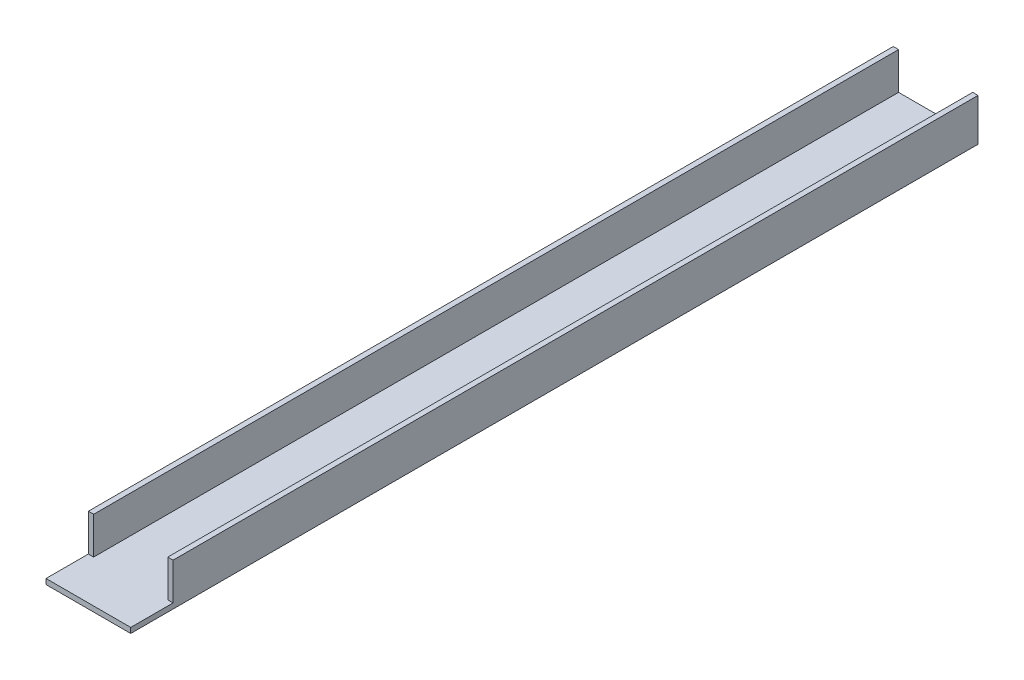
ISO-10303-21;
HEADER;
FILE_DESCRIPTION(('STEP AP214'),'2;1');
FILE_NAME('part.step','',(''),(''),'','','');
FILE_SCHEMA(('AUTOMOTIVE_DESIGN { 1 0 10303 214 1 1 1 1 }'));
ENDSEC;
DATA;
#1=APPLICATION_CONTEXT('core data for automotive mechanical design processes');
#2=APPLICATION_PROTOCOL_DEFINITION('international standard','automotive_design',2000,#1);
#3=PRODUCT_CONTEXT('',#1,'mechanical');
#4=PRODUCT('Part','Part','',(#3));
#5=PRODUCT_RELATED_PRODUCT_CATEGORY('part','',(#4));
#6=PRODUCT_DEFINITION_FORMATION('','',#4);
#7=PRODUCT_DEFINITION_CONTEXT('part definition',#1,'design');
#8=PRODUCT_DEFINITION('design','',#6,#7);
#9=PRODUCT_DEFINITION_SHAPE('','',#8);
#10=(LENGTH_UNIT() NAMED_UNIT(*) SI_UNIT(.MILLI.,.METRE.));
#11=(NAMED_UNIT(*) PLANE_ANGLE_UNIT() SI_UNIT($,.RADIAN.));
#12=(NAMED_UNIT(*) SI_UNIT($,.STERADIAN.) SOLID_ANGLE_UNIT());
#13=UNCERTAINTY_MEASURE_WITH_UNIT(LENGTH_MEASURE(1.E-05),#10,'distance_accuracy_value','');
#14=(GEOMETRIC_REPRESENTATION_CONTEXT(3) GLOBAL_UNCERTAINTY_ASSIGNED_CONTEXT((#13)) GLOBAL_UNIT_ASSIGNED_CONTEXT((#10,
#11,#12)) REPRESENTATION_CONTEXT('',''));
#15=CARTESIAN_POINT('',(0.,0.,0.));
#16=DIRECTION('',(0.,0.,1.));
#17=DIRECTION('',(1.,0.,0.));
#18=AXIS2_PLACEMENT_3D('',#15,#16,#17);
#19=CARTESIAN_POINT('',(0.,0.,508.));
#20=DIRECTION('',(1.,0.,0.));
#21=DIRECTION('',(0.,0.,-1.));
#22=AXIS2_PLACEMENT_3D('',#19,#20,#21);
#23=PLANE('',#22);
#24=DIRECTION('',(0.,-1.,0.));
#25=VECTOR('',#24,1.);
#26=CARTESIAN_POINT('',(0.,0.,508.));
#27=LINE('',#26,#25);
#28=CARTESIAN_POINT('',(0.,3.175,508.));
#29=VERTEX_POINT('',#28);
#30=CARTESIAN_POINT('',(0.,0.,508.));
#31=VERTEX_POINT('',#30);
#32=EDGE_CURVE('E113',#29,#31,#27,.T.);
#33=ORIENTED_EDGE('',*,*,#32,.F.);
#34=DIRECTION('',(0.,0.,1.));
#35=VECTOR('',#34,1.);
#36=CARTESIAN_POINT('',(0.,3.175,508.));
#37=LINE('',#36,#35);
#38=CARTESIAN_POINT('',(0.,3.175,482.6));
#39=VERTEX_POINT('',#38);
#40=EDGE_CURVE('E220',#39,#29,#37,.T.);
#41=ORIENTED_EDGE('',*,*,#40,.F.);
#42=DIRECTION('',(0.,1.,0.));
#43=VECTOR('',#42,1.);
#44=CARTESIAN_POINT('',(0.,-53.6211266284946,482.6));
#45=LINE('',#44,#43);
#46=CARTESIAN_POINT('',(0.,25.4,482.6));
#47=VERTEX_POINT('',#46);
#48=EDGE_CURVE('E100',#39,#47,#45,.T.);
#49=ORIENTED_EDGE('',*,*,#48,.T.);
#50=DIRECTION('',(0.,0.,-1.));
#51=VECTOR('',#50,1.);
#52=CARTESIAN_POINT('',(0.,25.4,508.));
#53=LINE('',#52,#51);
#54=CARTESIAN_POINT('',(0.,25.4,0.));
#55=VERTEX_POINT('',#54);
#56=EDGE_CURVE('E91',#47,#55,#53,.T.);
#57=ORIENTED_EDGE('',*,*,#56,.T.);
#58=DIRECTION('',(0.,-1.,0.));
#59=VECTOR('',#58,1.);
#60=CARTESIAN_POINT('',(0.,0.,0.));
#61=LINE('',#60,#59);
#62=CARTESIAN_POINT('',(0.,0.,0.));
#63=VERTEX_POINT('',#62);
#64=EDGE_CURVE('E96',#55,#63,#61,.T.);
#65=ORIENTED_EDGE('',*,*,#64,.T.);
#66=DIRECTION('',(0.,0.,-1.));
#67=VECTOR('',#66,1.);
#68=CARTESIAN_POINT('',(0.,0.,508.));
#69=LINE('',#68,#67);
#70=EDGE_CURVE('E11',#31,#63,#69,.T.);
#71=ORIENTED_EDGE('',*,*,#70,.F.);
#72=EDGE_LOOP('',(#33,#41,#49,#57,#65,#71));
#73=FACE_BOUND('',#72,.T.);
#74=ADVANCED_FACE('F38',(#73),#23,.F.);
#75=CARTESIAN_POINT('',(0.,0.,508.));
#76=DIRECTION('',(0.,1.,0.));
#77=DIRECTION('',(0.,0.,1.));
#78=AXIS2_PLACEMENT_3D('',#75,#76,#77);
#79=PLANE('',#78);
#80=DIRECTION('',(1.,0.,0.));
#81=VECTOR('',#80,1.);
#82=CARTESIAN_POINT('',(0.,0.,0.));
#83=LINE('',#82,#81);
#84=CARTESIAN_POINT('',(50.8,0.,0.));
#85=VERTEX_POINT('',#84);
#86=EDGE_CURVE('E118',#63,#85,#83,.T.);
#87=ORIENTED_EDGE('',*,*,#86,.T.);
#88=DIRECTION('',(0.,0.,-1.));
#89=VECTOR('',#88,1.);
#90=CARTESIAN_POINT('',(50.8,0.,508.));
#91=LINE('',#90,#89);
#92=CARTESIAN_POINT('',(50.8,0.,508.));
#93=VERTEX_POINT('',#92);
#94=EDGE_CURVE('E46',#93,#85,#91,.T.);
#95=ORIENTED_EDGE('',*,*,#94,.F.);
#96=DIRECTION('',(1.,0.,0.));
#97=VECTOR('',#96,1.);
#98=CARTESIAN_POINT('',(0.,0.,508.));
#99=LINE('',#98,#97);
#100=EDGE_CURVE('E59',#31,#93,#99,.T.);
#101=ORIENTED_EDGE('',*,*,#100,.F.);
#102=ORIENTED_EDGE('',*,*,#70,.T.);
#103=EDGE_LOOP('',(#87,#95,#101,#102));
#104=FACE_BOUND('',#103,.T.);
#105=ADVANCED_FACE('F236',(#104),#79,.F.);
#106=CARTESIAN_POINT('',(50.8,0.,508.));
#107=DIRECTION('',(-1.,0.,0.));
#108=DIRECTION('',(0.,0.,1.));
#109=AXIS2_PLACEMENT_3D('',#106,#107,#108);
#110=PLANE('',#109);
#111=DIRECTION('',(0.,1.,0.));
#112=VECTOR('',#111,1.);
#113=CARTESIAN_POINT('',(50.8,-53.6211266284946,482.6));
#114=LINE('',#113,#112);
#115=CARTESIAN_POINT('',(50.8,3.175,482.6));
#116=VERTEX_POINT('',#115);
#117=CARTESIAN_POINT('',(50.8,25.4,482.6));
#118=VERTEX_POINT('',#117);
#119=EDGE_CURVE('E177',#116,#118,#114,.T.);
#120=ORIENTED_EDGE('',*,*,#119,.F.);
#121=DIRECTION('',(0.,0.,-1.));
#122=VECTOR('',#121,1.);
#123=CARTESIAN_POINT('',(50.8,3.175,508.));
#124=LINE('',#123,#122);
#125=CARTESIAN_POINT('',(50.8,3.175,508.));
#126=VERTEX_POINT('',#125);
#127=EDGE_CURVE('E218',#126,#116,#124,.T.);
#128=ORIENTED_EDGE('',*,*,#127,.F.);
#129=DIRECTION('',(0.,1.,0.));
#130=VECTOR('',#129,1.);
#131=CARTESIAN_POINT('',(50.8,0.,508.));
#132=LINE('',#131,#130);
#133=EDGE_CURVE('E163',#93,#126,#132,.T.);
#134=ORIENTED_EDGE('',*,*,#133,.F.);
#135=ORIENTED_EDGE('',*,*,#94,.T.);
#136=DIRECTION('',(0.,1.,0.));
#137=VECTOR('',#136,1.);
#138=CARTESIAN_POINT('',(50.8,0.,0.));
#139=LINE('',#138,#137);
#140=CARTESIAN_POINT('',(50.8,25.4,0.));
#141=VERTEX_POINT('',#140);
#142=EDGE_CURVE('E121',#85,#141,#139,.T.);
#143=ORIENTED_EDGE('',*,*,#142,.T.);
#144=DIRECTION('',(0.,0.,-1.));
#145=VECTOR('',#144,1.);
#146=CARTESIAN_POINT('',(50.8,25.4,508.));
#147=LINE('',#146,#145);
#148=EDGE_CURVE('E152',#118,#141,#147,.T.);
#149=ORIENTED_EDGE('',*,*,#148,.F.);
#150=EDGE_LOOP('',(#120,#128,#134,#135,#143,#149));
#151=FACE_BOUND('',#150,.T.);
#152=ADVANCED_FACE('F159',(#151),#110,.F.);
#153=CARTESIAN_POINT('',(50.8,25.4,508.));
#154=DIRECTION('',(0.,-1.,0.));
#155=DIRECTION('',(0.,0.,-1.));
#156=AXIS2_PLACEMENT_3D('',#153,#154,#155);
#157=PLANE('',#156);
#158=DIRECTION('',(0.,0.,-1.));
#159=VECTOR('',#158,1.);
#160=CARTESIAN_POINT('',(47.625,25.4,508.));
#161=LINE('',#160,#159);
#162=CARTESIAN_POINT('',(47.625,25.4,482.6));
#163=VERTEX_POINT('',#162);
#164=CARTESIAN_POINT('',(47.625,25.4,0.));
#165=VERTEX_POINT('',#164);
#166=EDGE_CURVE('E149',#163,#165,#161,.T.);
#167=ORIENTED_EDGE('',*,*,#166,.F.);
#168=DIRECTION('',(-1.,0.,0.));
#169=VECTOR('',#168,1.);
#170=CARTESIAN_POINT('',(50.8,25.4,482.6));
#171=LINE('',#170,#169);
#172=EDGE_CURVE('E174',#118,#163,#171,.T.);
#173=ORIENTED_EDGE('',*,*,#172,.F.);
#174=ORIENTED_EDGE('',*,*,#148,.T.);
#175=DIRECTION('',(-1.,0.,0.));
#176=VECTOR('',#175,1.);
#177=CARTESIAN_POINT('',(50.8,25.4,0.));
#178=LINE('',#177,#176);
#179=EDGE_CURVE('E131',#141,#165,#178,.T.);
#180=ORIENTED_EDGE('',*,*,#179,.T.);
#181=EDGE_LOOP('',(#167,#173,#174,#180));
#182=FACE_BOUND('',#181,.T.);
#183=ADVANCED_FACE('F169',(#182),#157,.F.);
#184=CARTESIAN_POINT('',(47.625,3.175,508.));
#185=DIRECTION('',(1.,0.,0.));
#186=DIRECTION('',(0.,0.,-1.));
#187=AXIS2_PLACEMENT_3D('',#184,#185,#186);
#188=PLANE('',#187);
#189=DIRECTION('',(0.,0.,-1.));
#190=VECTOR('',#189,1.);
#191=CARTESIAN_POINT('',(47.625,3.175,508.));
#192=LINE('',#191,#190);
#193=CARTESIAN_POINT('',(47.625,3.175,482.6));
#194=VERTEX_POINT('',#193);
#195=CARTESIAN_POINT('',(47.625,3.175,0.));
#196=VERTEX_POINT('',#195);
#197=EDGE_CURVE('E146',#194,#196,#192,.T.);
#198=ORIENTED_EDGE('',*,*,#197,.F.);
#199=DIRECTION('',(0.,1.,0.));
#200=VECTOR('',#199,1.);
#201=CARTESIAN_POINT('',(47.625,3.175,482.6));
#202=LINE('',#201,#200);
#203=EDGE_CURVE('E119',#194,#163,#202,.T.);
#204=ORIENTED_EDGE('',*,*,#203,.T.);
#205=ORIENTED_EDGE('',*,*,#166,.T.);
#206=DIRECTION('',(0.,-1.,0.));
#207=VECTOR('',#206,1.);
#208=CARTESIAN_POINT('',(47.625,3.175,0.));
#209=LINE('',#208,#207);
#210=EDGE_CURVE('E134',#165,#196,#209,.T.);
#211=ORIENTED_EDGE('',*,*,#210,.T.);
#212=EDGE_LOOP('',(#198,#204,#205,#211));
#213=FACE_BOUND('',#212,.T.);
#214=ADVANCED_FACE('F213',(#213),#188,.F.);
#215=CARTESIAN_POINT('',(3.175,3.175,508.));
#216=DIRECTION('',(0.,-1.,0.));
#217=DIRECTION('',(0.,0.,-1.));
#218=AXIS2_PLACEMENT_3D('',#215,#216,#217);
#219=PLANE('',#218);
#220=DIRECTION('',(0.,0.,-1.));
#221=VECTOR('',#220,1.);
#222=CARTESIAN_POINT('',(3.175,3.175,508.));
#223=LINE('',#222,#221);
#224=CARTESIAN_POINT('',(3.175,3.175,482.6));
#225=VERTEX_POINT('',#224);
#226=CARTESIAN_POINT('',(3.175,3.175,0.));
#227=VERTEX_POINT('',#226);
#228=EDGE_CURVE('E143',#225,#227,#223,.T.);
#229=ORIENTED_EDGE('',*,*,#228,.F.);
#230=DIRECTION('',(-1.,0.,0.));
#231=VECTOR('',#230,1.);
#232=CARTESIAN_POINT('',(50.8,3.175,482.6));
#233=LINE('',#232,#231);
#234=EDGE_CURVE('E198',#225,#39,#233,.T.);
#235=ORIENTED_EDGE('',*,*,#234,.T.);
#236=ORIENTED_EDGE('',*,*,#40,.T.);
#237=DIRECTION('',(-1.,0.,0.));
#238=VECTOR('',#237,1.);
#239=CARTESIAN_POINT('',(3.175,3.175,508.));
#240=LINE('',#239,#238);
#241=EDGE_CURVE('E53',#126,#29,#240,.T.);
#242=ORIENTED_EDGE('',*,*,#241,.F.);
#243=ORIENTED_EDGE('',*,*,#127,.T.);
#244=EDGE_CURVE('E203',#116,#194,#233,.T.);
#245=ORIENTED_EDGE('',*,*,#244,.T.);
#246=ORIENTED_EDGE('',*,*,#197,.T.);
#247=DIRECTION('',(-1.,0.,0.));
#248=VECTOR('',#247,1.);
#249=CARTESIAN_POINT('',(3.175,3.175,0.));
#250=LINE('',#249,#248);
#251=EDGE_CURVE('E137',#196,#227,#250,.T.);
#252=ORIENTED_EDGE('',*,*,#251,.T.);
#253=EDGE_LOOP('',(#229,#235,#236,#242,#243,#245,#246,#252));
#254=FACE_BOUND('',#253,.T.);
#255=ADVANCED_FACE('F208',(#254),#219,.F.);
#256=CARTESIAN_POINT('',(3.175,3.175,508.));
#257=DIRECTION('',(-1.,0.,0.));
#258=DIRECTION('',(0.,0.,1.));
#259=AXIS2_PLACEMENT_3D('',#256,#257,#258);
#260=PLANE('',#259);
#261=DIRECTION('',(0.,0.,-1.));
#262=VECTOR('',#261,1.);
#263=CARTESIAN_POINT('',(3.175,25.4,508.));
#264=LINE('',#263,#262);
#265=CARTESIAN_POINT('',(3.175,25.4,482.6));
#266=VERTEX_POINT('',#265);
#267=CARTESIAN_POINT('',(3.175,25.4,0.));
#268=VERTEX_POINT('',#267);
#269=EDGE_CURVE('E104',#266,#268,#264,.T.);
#270=ORIENTED_EDGE('',*,*,#269,.F.);
#271=DIRECTION('',(0.,-1.,0.));
#272=VECTOR('',#271,1.);
#273=CARTESIAN_POINT('',(3.175,3.175,482.6));
#274=LINE('',#273,#272);
#275=EDGE_CURVE('E124',#266,#225,#274,.T.);
#276=ORIENTED_EDGE('',*,*,#275,.T.);
#277=ORIENTED_EDGE('',*,*,#228,.T.);
#278=DIRECTION('',(0.,1.,0.));
#279=VECTOR('',#278,1.);
#280=CARTESIAN_POINT('',(3.175,3.175,0.));
#281=LINE('',#280,#279);
#282=EDGE_CURVE('E114',#227,#268,#281,.T.);
#283=ORIENTED_EDGE('',*,*,#282,.T.);
#284=EDGE_LOOP('',(#270,#276,#277,#283));
#285=FACE_BOUND('',#284,.T.);
#286=ADVANCED_FACE('F206',(#285),#260,.F.);
#287=CARTESIAN_POINT('',(0.,25.4,508.));
#288=DIRECTION('',(0.,-1.,0.));
#289=DIRECTION('',(0.,0.,-1.));
#290=AXIS2_PLACEMENT_3D('',#287,#288,#289);
#291=PLANE('',#290);
#292=ORIENTED_EDGE('',*,*,#56,.F.);
#293=EDGE_CURVE('E215',#266,#47,#171,.T.);
#294=ORIENTED_EDGE('',*,*,#293,.F.);
#295=ORIENTED_EDGE('',*,*,#269,.T.);
#296=DIRECTION('',(-1.,0.,0.));
#297=VECTOR('',#296,1.);
#298=CARTESIAN_POINT('',(0.,25.4,0.));
#299=LINE('',#298,#297);
#300=EDGE_CURVE('E107',#268,#55,#299,.T.);
#301=ORIENTED_EDGE('',*,*,#300,.T.);
#302=EDGE_LOOP('',(#292,#294,#295,#301));
#303=FACE_BOUND('',#302,.T.);
#304=ADVANCED_FACE('F108',(#303),#291,.F.);
#305=CARTESIAN_POINT('',(0.,0.,508.));
#306=DIRECTION('',(0.,0.,-1.));
#307=DIRECTION('',(-1.,0.,0.));
#308=AXIS2_PLACEMENT_3D('',#305,#306,#307);
#309=PLANE('',#308);
#310=ORIENTED_EDGE('',*,*,#133,.T.);
#311=ORIENTED_EDGE('',*,*,#241,.T.);
#312=ORIENTED_EDGE('',*,*,#32,.T.);
#313=ORIENTED_EDGE('',*,*,#100,.T.);
#314=EDGE_LOOP('',(#310,#311,#312,#313));
#315=FACE_BOUND('',#314,.T.);
#316=ADVANCED_FACE('F225',(#315),#309,.F.);
#317=CARTESIAN_POINT('',(0.,0.,0.));
#318=DIRECTION('',(0.,0.,-1.));
#319=DIRECTION('',(-1.,0.,0.));
#320=AXIS2_PLACEMENT_3D('',#317,#318,#319);
#321=PLANE('',#320);
#322=ORIENTED_EDGE('',*,*,#64,.F.);
#323=ORIENTED_EDGE('',*,*,#300,.F.);
#324=ORIENTED_EDGE('',*,*,#282,.F.);
#325=ORIENTED_EDGE('',*,*,#251,.F.);
#326=ORIENTED_EDGE('',*,*,#210,.F.);
#327=ORIENTED_EDGE('',*,*,#179,.F.);
#328=ORIENTED_EDGE('',*,*,#142,.F.);
#329=ORIENTED_EDGE('',*,*,#86,.F.);
#330=EDGE_LOOP('',(#322,#323,#324,#325,#326,#327,#328,#329));
#331=FACE_BOUND('',#330,.T.);
#332=ADVANCED_FACE('F116',(#331),#321,.T.);
#333=CARTESIAN_POINT('',(50.8,-53.6211266284946,482.6));
#334=DIRECTION('',(0.,0.,-1.));
#335=DIRECTION('',(-1.,0.,0.));
#336=AXIS2_PLACEMENT_3D('',#333,#334,#335);
#337=PLANE('',#336);
#338=ORIENTED_EDGE('',*,*,#293,.T.);
#339=ORIENTED_EDGE('',*,*,#48,.F.);
#340=ORIENTED_EDGE('',*,*,#234,.F.);
#341=ORIENTED_EDGE('',*,*,#275,.F.);
#342=EDGE_LOOP('',(#338,#339,#340,#341));
#343=FACE_BOUND('',#342,.T.);
#344=ADVANCED_FACE('F200',(#343),#337,.F.);
#345=ORIENTED_EDGE('',*,*,#244,.F.);
#346=ORIENTED_EDGE('',*,*,#119,.T.);
#347=ORIENTED_EDGE('',*,*,#172,.T.);
#348=ORIENTED_EDGE('',*,*,#203,.F.);
#349=EDGE_LOOP('',(#345,#346,#347,#348));
#350=FACE_BOUND('',#349,.T.);
#351=ADVANCED_FACE('F214',(#350),#337,.F.);
#352=CLOSED_SHELL('',(#74,#105,#152,#183,#214,#255,#286,#304,#316,#332,#344,#351));
#353=MANIFOLD_SOLID_BREP('B2',#352);
#354=ADVANCED_BREP_SHAPE_REPRESENTATION('',(#18,#353),#14);
#355=SHAPE_DEFINITION_REPRESENTATION(#9,#354);
ENDSEC;
END-ISO-10303-21;
